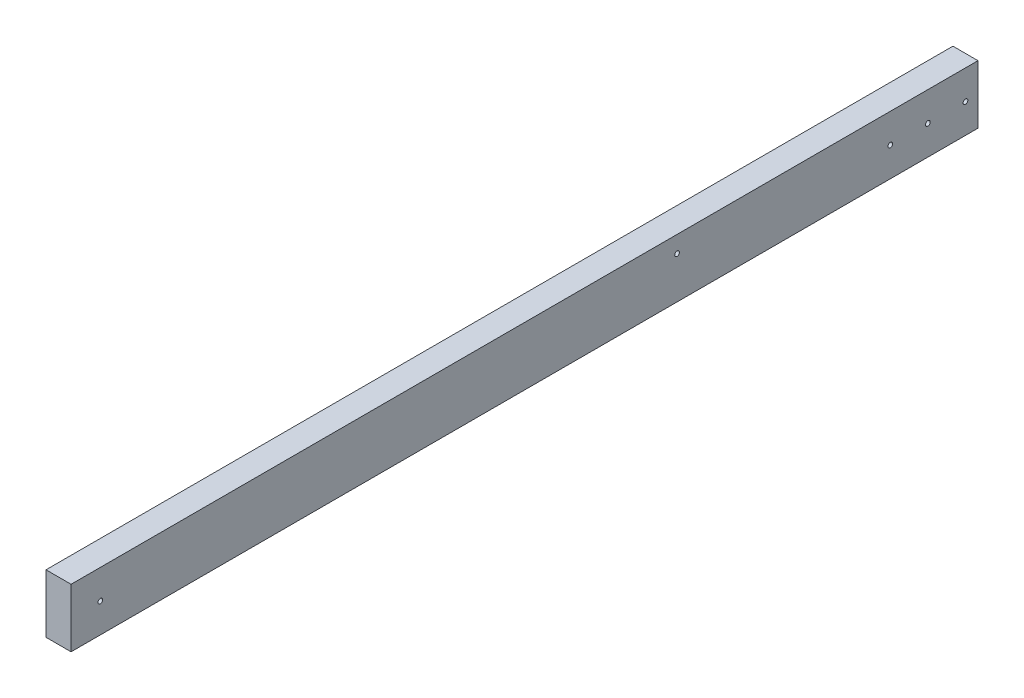
ISO-10303-21;
HEADER;
FILE_DESCRIPTION(('STEP AP214'),'2;1');
FILE_NAME('part.step','',(''),(''),'','','');
FILE_SCHEMA(('AUTOMOTIVE_DESIGN { 1 0 10303 214 1 1 1 1 }'));
ENDSEC;
DATA;
#1=APPLICATION_CONTEXT('core data for automotive mechanical design processes');
#2=APPLICATION_PROTOCOL_DEFINITION('international standard','automotive_design',2000,#1);
#3=PRODUCT_CONTEXT('',#1,'mechanical');
#4=PRODUCT('Part','Part','',(#3));
#5=PRODUCT_RELATED_PRODUCT_CATEGORY('part','',(#4));
#6=PRODUCT_DEFINITION_FORMATION('','',#4);
#7=PRODUCT_DEFINITION_CONTEXT('part definition',#1,'design');
#8=PRODUCT_DEFINITION('design','',#6,#7);
#9=PRODUCT_DEFINITION_SHAPE('','',#8);
#10=(LENGTH_UNIT() NAMED_UNIT(*) SI_UNIT(.MILLI.,.METRE.));
#11=(NAMED_UNIT(*) PLANE_ANGLE_UNIT() SI_UNIT($,.RADIAN.));
#12=(NAMED_UNIT(*) SI_UNIT($,.STERADIAN.) SOLID_ANGLE_UNIT());
#13=UNCERTAINTY_MEASURE_WITH_UNIT(LENGTH_MEASURE(1.E-05),#10,'distance_accuracy_value','');
#14=(GEOMETRIC_REPRESENTATION_CONTEXT(3) GLOBAL_UNCERTAINTY_ASSIGNED_CONTEXT((#13)) GLOBAL_UNIT_ASSIGNED_CONTEXT((#10,
#11,#12)) REPRESENTATION_CONTEXT('',''));
#15=CARTESIAN_POINT('',(0.,0.,0.));
#16=DIRECTION('',(0.,0.,1.));
#17=DIRECTION('',(1.,0.,0.));
#18=AXIS2_PLACEMENT_3D('',#15,#16,#17);
#19=CARTESIAN_POINT('',(19.05,-44.45,1377.95));
#20=DIRECTION('',(-1.,0.,0.));
#21=DIRECTION('',(0.,0.,1.));
#22=AXIS2_PLACEMENT_3D('',#19,#20,#21);
#23=PLANE('',#22);
#24=CARTESIAN_POINT('',(19.05,0.,19.05));
#25=DIRECTION('',(1.,0.,0.));
#26=DIRECTION('',(0.,0.,-1.));
#27=AXIS2_PLACEMENT_3D('',#24,#25,#26);
#28=CIRCLE('',#27,3.571875);
#29=CARTESIAN_POINT('',(19.05,0.,15.478125));
#30=VERTEX_POINT('',#29);
#31=EDGE_CURVE('E135',#30,#30,#28,.T.);
#32=ORIENTED_EDGE('',*,*,#31,.F.);
#33=EDGE_LOOP('',(#32));
#34=FACE_BOUND('',#33,.T.);
#35=CARTESIAN_POINT('',(19.05,0.,76.2));
#36=DIRECTION('',(1.,0.,0.));
#37=DIRECTION('',(0.,0.,-1.));
#38=AXIS2_PLACEMENT_3D('',#35,#36,#37);
#39=CIRCLE('',#38,3.571875);
#40=CARTESIAN_POINT('',(19.05,0.,72.628125));
#41=VERTEX_POINT('',#40);
#42=EDGE_CURVE('E129',#41,#41,#39,.T.);
#43=ORIENTED_EDGE('',*,*,#42,.F.);
#44=EDGE_LOOP('',(#43));
#45=FACE_BOUND('',#44,.T.);
#46=CARTESIAN_POINT('',(19.05,0.,133.35));
#47=DIRECTION('',(1.,0.,0.));
#48=DIRECTION('',(0.,0.,-1.));
#49=AXIS2_PLACEMENT_3D('',#46,#47,#48);
#50=CIRCLE('',#49,3.571875);
#51=CARTESIAN_POINT('',(19.05,0.,129.778125));
#52=VERTEX_POINT('',#51);
#53=EDGE_CURVE('E123',#52,#52,#50,.T.);
#54=ORIENTED_EDGE('',*,*,#53,.F.);
#55=EDGE_LOOP('',(#54));
#56=FACE_BOUND('',#55,.T.);
#57=CARTESIAN_POINT('',(19.05,0.,1333.5));
#58=DIRECTION('',(1.,0.,0.));
#59=DIRECTION('',(0.,0.,-1.));
#60=AXIS2_PLACEMENT_3D('',#57,#58,#59);
#61=CIRCLE('',#60,3.571875);
#62=CARTESIAN_POINT('',(19.05,0.,1329.928125));
#63=VERTEX_POINT('',#62);
#64=EDGE_CURVE('E117',#63,#63,#61,.T.);
#65=ORIENTED_EDGE('',*,*,#64,.F.);
#66=EDGE_LOOP('',(#65));
#67=FACE_BOUND('',#66,.T.);
#68=CARTESIAN_POINT('',(19.05,19.05,457.2));
#69=DIRECTION('',(1.,0.,0.));
#70=DIRECTION('',(0.,0.,-1.));
#71=AXIS2_PLACEMENT_3D('',#68,#69,#70);
#72=CIRCLE('',#71,3.571875);
#73=CARTESIAN_POINT('',(19.05,19.05,453.628125));
#74=VERTEX_POINT('',#73);
#75=EDGE_CURVE('E111',#74,#74,#72,.T.);
#76=ORIENTED_EDGE('',*,*,#75,.F.);
#77=EDGE_LOOP('',(#76));
#78=FACE_BOUND('',#77,.T.);
#79=DIRECTION('',(0.,1.,0.));
#80=VECTOR('',#79,1.);
#81=CARTESIAN_POINT('',(19.05,-44.45,0.));
#82=LINE('',#81,#80);
#83=CARTESIAN_POINT('',(19.05,-44.45,0.));
#84=VERTEX_POINT('',#83);
#85=CARTESIAN_POINT('',(19.05,44.45,0.));
#86=VERTEX_POINT('',#85);
#87=EDGE_CURVE('E95',#84,#86,#82,.T.);
#88=ORIENTED_EDGE('',*,*,#87,.T.);
#89=DIRECTION('',(0.,0.,-1.));
#90=VECTOR('',#89,1.);
#91=CARTESIAN_POINT('',(19.05,44.45,1377.95));
#92=LINE('',#91,#90);
#93=CARTESIAN_POINT('',(19.05,44.45,1377.95));
#94=VERTEX_POINT('',#93);
#95=EDGE_CURVE('E11',#94,#86,#92,.T.);
#96=ORIENTED_EDGE('',*,*,#95,.F.);
#97=DIRECTION('',(0.,1.,0.));
#98=VECTOR('',#97,1.);
#99=CARTESIAN_POINT('',(19.05,-44.45,1377.95));
#100=LINE('',#99,#98);
#101=CARTESIAN_POINT('',(19.05,-44.45,1377.95));
#102=VERTEX_POINT('',#101);
#103=EDGE_CURVE('E83',#102,#94,#100,.T.);
#104=ORIENTED_EDGE('',*,*,#103,.F.);
#105=DIRECTION('',(0.,0.,-1.));
#106=VECTOR('',#105,1.);
#107=CARTESIAN_POINT('',(19.05,-44.45,1377.95));
#108=LINE('',#107,#106);
#109=EDGE_CURVE('E91',#102,#84,#108,.T.);
#110=ORIENTED_EDGE('',*,*,#109,.T.);
#111=EDGE_LOOP('',(#88,#96,#104,#110));
#112=FACE_BOUND('',#111,.T.);
#113=ADVANCED_FACE('F32',(#34,#45,#56,#67,#78,#112),#23,.F.);
#114=CARTESIAN_POINT('',(-19.05,44.45,1377.95));
#115=DIRECTION('',(0.,-1.,0.));
#116=DIRECTION('',(0.,0.,-1.));
#117=AXIS2_PLACEMENT_3D('',#114,#115,#116);
#118=PLANE('',#117);
#119=DIRECTION('',(-1.,0.,0.));
#120=VECTOR('',#119,1.);
#121=CARTESIAN_POINT('',(-19.05,44.45,0.));
#122=LINE('',#121,#120);
#123=CARTESIAN_POINT('',(-19.05,44.45,0.));
#124=VERTEX_POINT('',#123);
#125=EDGE_CURVE('E87',#86,#124,#122,.T.);
#126=ORIENTED_EDGE('',*,*,#125,.T.);
#127=DIRECTION('',(0.,0.,-1.));
#128=VECTOR('',#127,1.);
#129=CARTESIAN_POINT('',(-19.05,44.45,1377.95));
#130=LINE('',#129,#128);
#131=CARTESIAN_POINT('',(-19.05,44.45,1377.95));
#132=VERTEX_POINT('',#131);
#133=EDGE_CURVE('E40',#132,#124,#130,.T.);
#134=ORIENTED_EDGE('',*,*,#133,.F.);
#135=DIRECTION('',(-1.,0.,0.));
#136=VECTOR('',#135,1.);
#137=CARTESIAN_POINT('',(-19.05,44.45,1377.95));
#138=LINE('',#137,#136);
#139=EDGE_CURVE('E78',#94,#132,#138,.T.);
#140=ORIENTED_EDGE('',*,*,#139,.F.);
#141=ORIENTED_EDGE('',*,*,#95,.T.);
#142=EDGE_LOOP('',(#126,#134,#140,#141));
#143=FACE_BOUND('',#142,.T.);
#144=ADVANCED_FACE('F86',(#143),#118,.F.);
#145=CARTESIAN_POINT('',(-19.05,-44.45,1377.95));
#146=DIRECTION('',(1.,0.,0.));
#147=DIRECTION('',(0.,0.,-1.));
#148=AXIS2_PLACEMENT_3D('',#145,#146,#147);
#149=PLANE('',#148);
#150=CARTESIAN_POINT('',(-19.05,0.,19.05));
#151=DIRECTION('',(1.,0.,0.));
#152=DIRECTION('',(0.,0.,-1.));
#153=AXIS2_PLACEMENT_3D('',#150,#151,#152);
#154=CIRCLE('',#153,3.57187499999999);
#155=CARTESIAN_POINT('',(-19.05,0.,15.478125));
#156=VERTEX_POINT('',#155);
#157=EDGE_CURVE('E132',#156,#156,#154,.T.);
#158=ORIENTED_EDGE('',*,*,#157,.T.);
#159=EDGE_LOOP('',(#158));
#160=FACE_BOUND('',#159,.T.);
#161=CARTESIAN_POINT('',(-19.05,0.,76.2));
#162=DIRECTION('',(1.,0.,0.));
#163=DIRECTION('',(0.,0.,-1.));
#164=AXIS2_PLACEMENT_3D('',#161,#162,#163);
#165=CIRCLE('',#164,3.57187499999999);
#166=CARTESIAN_POINT('',(-19.05,0.,72.628125));
#167=VERTEX_POINT('',#166);
#168=EDGE_CURVE('E126',#167,#167,#165,.T.);
#169=ORIENTED_EDGE('',*,*,#168,.T.);
#170=EDGE_LOOP('',(#169));
#171=FACE_BOUND('',#170,.T.);
#172=CARTESIAN_POINT('',(-19.05,0.,133.35));
#173=DIRECTION('',(1.,0.,0.));
#174=DIRECTION('',(0.,0.,-1.));
#175=AXIS2_PLACEMENT_3D('',#172,#173,#174);
#176=CIRCLE('',#175,3.57187499999999);
#177=CARTESIAN_POINT('',(-19.05,0.,129.778125));
#178=VERTEX_POINT('',#177);
#179=EDGE_CURVE('E120',#178,#178,#176,.T.);
#180=ORIENTED_EDGE('',*,*,#179,.T.);
#181=EDGE_LOOP('',(#180));
#182=FACE_BOUND('',#181,.T.);
#183=CARTESIAN_POINT('',(-19.05,0.,1333.5));
#184=DIRECTION('',(1.,0.,0.));
#185=DIRECTION('',(0.,0.,-1.));
#186=AXIS2_PLACEMENT_3D('',#183,#184,#185);
#187=CIRCLE('',#186,3.57187499999999);
#188=CARTESIAN_POINT('',(-19.05,0.,1329.928125));
#189=VERTEX_POINT('',#188);
#190=EDGE_CURVE('E114',#189,#189,#187,.T.);
#191=ORIENTED_EDGE('',*,*,#190,.T.);
#192=EDGE_LOOP('',(#191));
#193=FACE_BOUND('',#192,.T.);
#194=CARTESIAN_POINT('',(-19.05,19.05,457.2));
#195=DIRECTION('',(1.,0.,0.));
#196=DIRECTION('',(0.,0.,-1.));
#197=AXIS2_PLACEMENT_3D('',#194,#195,#196);
#198=CIRCLE('',#197,3.57187499999999);
#199=CARTESIAN_POINT('',(-19.05,19.05,453.628125));
#200=VERTEX_POINT('',#199);
#201=EDGE_CURVE('E98',#200,#200,#198,.T.);
#202=ORIENTED_EDGE('',*,*,#201,.T.);
#203=EDGE_LOOP('',(#202));
#204=FACE_BOUND('',#203,.T.);
#205=DIRECTION('',(0.,-1.,0.));
#206=VECTOR('',#205,1.);
#207=CARTESIAN_POINT('',(-19.05,-44.45,0.));
#208=LINE('',#207,#206);
#209=CARTESIAN_POINT('',(-19.05,-44.45,0.));
#210=VERTEX_POINT('',#209);
#211=EDGE_CURVE('E65',#124,#210,#208,.T.);
#212=ORIENTED_EDGE('',*,*,#211,.T.);
#213=DIRECTION('',(0.,0.,-1.));
#214=VECTOR('',#213,1.);
#215=CARTESIAN_POINT('',(-19.05,-44.45,1377.95));
#216=LINE('',#215,#214);
#217=CARTESIAN_POINT('',(-19.05,-44.45,1377.95));
#218=VERTEX_POINT('',#217);
#219=EDGE_CURVE('E88',#218,#210,#216,.T.);
#220=ORIENTED_EDGE('',*,*,#219,.F.);
#221=DIRECTION('',(0.,-1.,0.));
#222=VECTOR('',#221,1.);
#223=CARTESIAN_POINT('',(-19.05,-44.45,1377.95));
#224=LINE('',#223,#222);
#225=EDGE_CURVE('E81',#132,#218,#224,.T.);
#226=ORIENTED_EDGE('',*,*,#225,.F.);
#227=ORIENTED_EDGE('',*,*,#133,.T.);
#228=EDGE_LOOP('',(#212,#220,#226,#227));
#229=FACE_BOUND('',#228,.T.);
#230=ADVANCED_FACE('F89',(#160,#171,#182,#193,#204,#229),#149,.F.);
#231=CARTESIAN_POINT('',(-19.05,-44.45,1377.95));
#232=DIRECTION('',(0.,1.,0.));
#233=DIRECTION('',(0.,0.,1.));
#234=AXIS2_PLACEMENT_3D('',#231,#232,#233);
#235=PLANE('',#234);
#236=DIRECTION('',(1.,0.,0.));
#237=VECTOR('',#236,1.);
#238=CARTESIAN_POINT('',(-19.05,-44.45,0.));
#239=LINE('',#238,#237);
#240=EDGE_CURVE('E71',#210,#84,#239,.T.);
#241=ORIENTED_EDGE('',*,*,#240,.T.);
#242=ORIENTED_EDGE('',*,*,#109,.F.);
#243=DIRECTION('',(1.,0.,0.));
#244=VECTOR('',#243,1.);
#245=CARTESIAN_POINT('',(-19.05,-44.45,1377.95));
#246=LINE('',#245,#244);
#247=EDGE_CURVE('E48',#218,#102,#246,.T.);
#248=ORIENTED_EDGE('',*,*,#247,.F.);
#249=ORIENTED_EDGE('',*,*,#219,.T.);
#250=EDGE_LOOP('',(#241,#242,#248,#249));
#251=FACE_BOUND('',#250,.T.);
#252=ADVANCED_FACE('F103',(#251),#235,.F.);
#253=CARTESIAN_POINT('',(0.,0.,1377.95));
#254=DIRECTION('',(0.,0.,-1.));
#255=DIRECTION('',(-1.,0.,0.));
#256=AXIS2_PLACEMENT_3D('',#253,#254,#255);
#257=PLANE('',#256);
#258=ORIENTED_EDGE('',*,*,#103,.T.);
#259=ORIENTED_EDGE('',*,*,#139,.T.);
#260=ORIENTED_EDGE('',*,*,#225,.T.);
#261=ORIENTED_EDGE('',*,*,#247,.T.);
#262=EDGE_LOOP('',(#258,#259,#260,#261));
#263=FACE_BOUND('',#262,.T.);
#264=ADVANCED_FACE('F79',(#263),#257,.F.);
#265=CARTESIAN_POINT('',(0.,0.,0.));
#266=DIRECTION('',(0.,0.,-1.));
#267=DIRECTION('',(-1.,0.,0.));
#268=AXIS2_PLACEMENT_3D('',#265,#266,#267);
#269=PLANE('',#268);
#270=ORIENTED_EDGE('',*,*,#87,.F.);
#271=ORIENTED_EDGE('',*,*,#240,.F.);
#272=ORIENTED_EDGE('',*,*,#211,.F.);
#273=ORIENTED_EDGE('',*,*,#125,.F.);
#274=EDGE_LOOP('',(#270,#271,#272,#273));
#275=FACE_BOUND('',#274,.T.);
#276=ADVANCED_FACE('F106',(#275),#269,.T.);
#277=CARTESIAN_POINT('',(19.05,19.05,457.2));
#278=DIRECTION('',(1.,0.,0.));
#279=DIRECTION('',(0.,0.,-1.));
#280=AXIS2_PLACEMENT_3D('',#277,#278,#279);
#281=CYLINDRICAL_SURFACE('',#280,3.57187499999999);
#282=ORIENTED_EDGE('',*,*,#201,.F.);
#283=EDGE_LOOP('',(#282));
#284=FACE_BOUND('',#283,.T.);
#285=ORIENTED_EDGE('',*,*,#75,.T.);
#286=EDGE_LOOP('',(#285));
#287=FACE_BOUND('',#286,.T.);
#288=ADVANCED_FACE('F151',(#284,#287),#281,.F.);
#289=CARTESIAN_POINT('',(19.05,0.,1333.5));
#290=DIRECTION('',(1.,0.,0.));
#291=DIRECTION('',(0.,0.,-1.));
#292=AXIS2_PLACEMENT_3D('',#289,#290,#291);
#293=CYLINDRICAL_SURFACE('',#292,3.57187499999999);
#294=ORIENTED_EDGE('',*,*,#190,.F.);
#295=EDGE_LOOP('',(#294));
#296=FACE_BOUND('',#295,.T.);
#297=ORIENTED_EDGE('',*,*,#64,.T.);
#298=EDGE_LOOP('',(#297));
#299=FACE_BOUND('',#298,.T.);
#300=ADVANCED_FACE('F153',(#296,#299),#293,.F.);
#301=CARTESIAN_POINT('',(19.05,0.,133.35));
#302=DIRECTION('',(1.,0.,0.));
#303=DIRECTION('',(0.,0.,-1.));
#304=AXIS2_PLACEMENT_3D('',#301,#302,#303);
#305=CYLINDRICAL_SURFACE('',#304,3.57187499999999);
#306=ORIENTED_EDGE('',*,*,#179,.F.);
#307=EDGE_LOOP('',(#306));
#308=FACE_BOUND('',#307,.T.);
#309=ORIENTED_EDGE('',*,*,#53,.T.);
#310=EDGE_LOOP('',(#309));
#311=FACE_BOUND('',#310,.T.);
#312=ADVANCED_FACE('F160',(#308,#311),#305,.F.);
#313=CARTESIAN_POINT('',(19.05,0.,76.2));
#314=DIRECTION('',(1.,0.,0.));
#315=DIRECTION('',(0.,0.,-1.));
#316=AXIS2_PLACEMENT_3D('',#313,#314,#315);
#317=CYLINDRICAL_SURFACE('',#316,3.57187499999999);
#318=ORIENTED_EDGE('',*,*,#168,.F.);
#319=EDGE_LOOP('',(#318));
#320=FACE_BOUND('',#319,.T.);
#321=ORIENTED_EDGE('',*,*,#42,.T.);
#322=EDGE_LOOP('',(#321));
#323=FACE_BOUND('',#322,.T.);
#324=ADVANCED_FACE('F225',(#320,#323),#317,.F.);
#325=CARTESIAN_POINT('',(19.05,0.,19.05));
#326=DIRECTION('',(1.,0.,0.));
#327=DIRECTION('',(0.,0.,-1.));
#328=AXIS2_PLACEMENT_3D('',#325,#326,#327);
#329=CYLINDRICAL_SURFACE('',#328,3.57187499999999);
#330=ORIENTED_EDGE('',*,*,#157,.F.);
#331=EDGE_LOOP('',(#330));
#332=FACE_BOUND('',#331,.T.);
#333=ORIENTED_EDGE('',*,*,#31,.T.);
#334=EDGE_LOOP('',(#333));
#335=FACE_BOUND('',#334,.T.);
#336=ADVANCED_FACE('F139',(#332,#335),#329,.F.);
#337=CLOSED_SHELL('',(#113,#144,#230,#252,#264,#276,#288,#300,#312,#324,#336));
#338=MANIFOLD_SOLID_BREP('B2',#337);
#339=ADVANCED_BREP_SHAPE_REPRESENTATION('',(#18,#338),#14);
#340=SHAPE_DEFINITION_REPRESENTATION(#9,#339);
ENDSEC;
END-ISO-10303-21;
